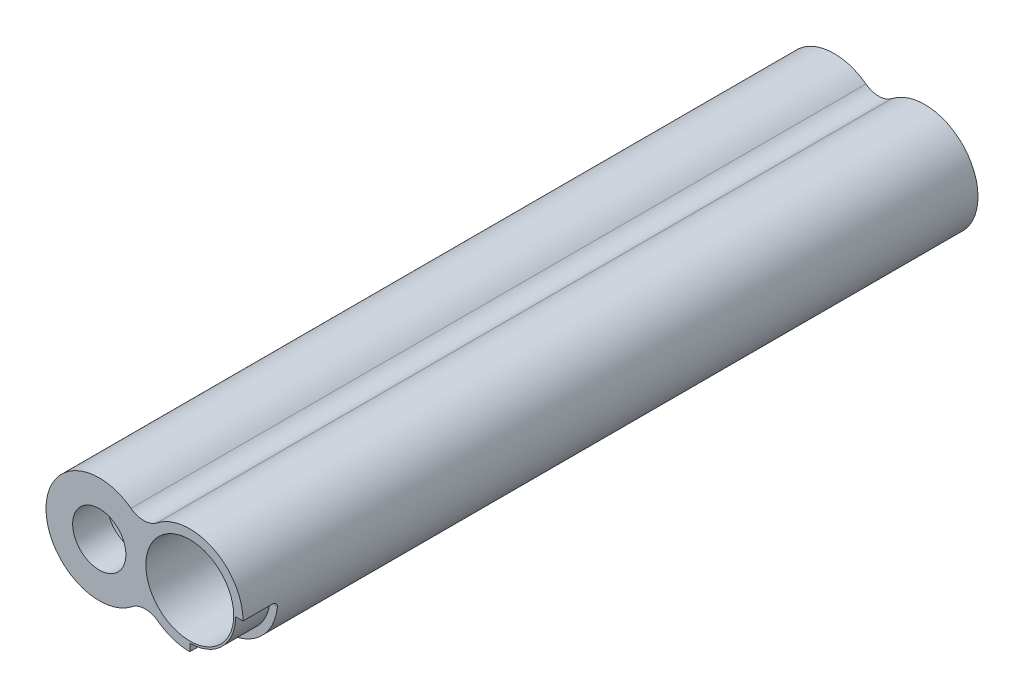
ISO-10303-21;
HEADER;
FILE_DESCRIPTION(('STEP AP214'),'2;1');
FILE_NAME('part.step','',(''),(''),'','','');
FILE_SCHEMA(('AUTOMOTIVE_DESIGN { 1 0 10303 214 1 1 1 1 }'));
ENDSEC;
DATA;
#1=APPLICATION_CONTEXT('core data for automotive mechanical design processes');
#2=APPLICATION_PROTOCOL_DEFINITION('international standard','automotive_design',2000,#1);
#3=PRODUCT_CONTEXT('',#1,'mechanical');
#4=PRODUCT('Part','Part','',(#3));
#5=PRODUCT_RELATED_PRODUCT_CATEGORY('part','',(#4));
#6=PRODUCT_DEFINITION_FORMATION('','',#4);
#7=PRODUCT_DEFINITION_CONTEXT('part definition',#1,'design');
#8=PRODUCT_DEFINITION('design','',#6,#7);
#9=PRODUCT_DEFINITION_SHAPE('','',#8);
#10=(LENGTH_UNIT() NAMED_UNIT(*) SI_UNIT(.MILLI.,.METRE.));
#11=(NAMED_UNIT(*) PLANE_ANGLE_UNIT() SI_UNIT($,.RADIAN.));
#12=(NAMED_UNIT(*) SI_UNIT($,.STERADIAN.) SOLID_ANGLE_UNIT());
#13=UNCERTAINTY_MEASURE_WITH_UNIT(LENGTH_MEASURE(1.E-05),#10,'distance_accuracy_value','');
#14=(GEOMETRIC_REPRESENTATION_CONTEXT(3) GLOBAL_UNCERTAINTY_ASSIGNED_CONTEXT((#13)) GLOBAL_UNIT_ASSIGNED_CONTEXT((#10,
#11,#12)) REPRESENTATION_CONTEXT('',''));
#15=CARTESIAN_POINT('',(0.,0.,0.));
#16=DIRECTION('',(0.,0.,1.));
#17=DIRECTION('',(1.,0.,0.));
#18=AXIS2_PLACEMENT_3D('',#15,#16,#17);
#19=CARTESIAN_POINT('',(8.49999999999999,0.106093378403053,-34.5));
#20=DIRECTION('',(0.,0.,1.));
#21=DIRECTION('',(1.,0.,0.));
#22=AXIS2_PLACEMENT_3D('',#19,#20,#21);
#23=CYLINDRICAL_SURFACE('',#22,4.125);
#24=CARTESIAN_POINT('',(8.49999999999999,0.106093378403053,34.5));
#25=DIRECTION('',(0.,0.,1.));
#26=DIRECTION('',(1.,0.,0.));
#27=AXIS2_PLACEMENT_3D('',#24,#25,#26);
#28=CIRCLE('',#27,4.125);
#29=CARTESIAN_POINT('',(12.625,0.106093378403053,34.5));
#30=VERTEX_POINT('',#29);
#31=EDGE_CURVE('E243',#30,#30,#28,.T.);
#32=ORIENTED_EDGE('',*,*,#31,.T.);
#33=EDGE_LOOP('',(#32));
#34=FACE_BOUND('',#33,.T.);
#35=CARTESIAN_POINT('',(8.49999999999999,0.106093378403053,-31.25));
#36=DIRECTION('',(0.,0.,-1.));
#37=DIRECTION('',(-1.,0.,0.));
#38=AXIS2_PLACEMENT_3D('',#35,#36,#37);
#39=CIRCLE('',#38,4.125);
#40=CARTESIAN_POINT('',(4.37499999999999,0.106093378403053,-31.25));
#41=VERTEX_POINT('',#40);
#42=EDGE_CURVE('E302',#41,#41,#39,.F.);
#43=ORIENTED_EDGE('',*,*,#42,.F.);
#44=EDGE_LOOP('',(#43));
#45=FACE_BOUND('',#44,.T.);
#46=ADVANCED_FACE('F42',(#34,#45),#23,.F.);
#47=CARTESIAN_POINT('',(0.,0.,-34.5));
#48=DIRECTION('',(0.,0.,1.));
#49=DIRECTION('',(1.,0.,0.));
#50=AXIS2_PLACEMENT_3D('',#47,#48,#49);
#51=CYLINDRICAL_SURFACE('',#50,4.125);
#52=CARTESIAN_POINT('',(0.,0.,-34.5));
#53=DIRECTION('',(0.,0.,1.));
#54=DIRECTION('',(1.,0.,0.));
#55=AXIS2_PLACEMENT_3D('',#52,#53,#54);
#56=CIRCLE('',#55,4.125);
#57=CARTESIAN_POINT('',(4.125,0.,-34.5));
#58=VERTEX_POINT('',#57);
#59=EDGE_CURVE('E247',#58,#58,#56,.T.);
#60=ORIENTED_EDGE('',*,*,#59,.F.);
#61=EDGE_LOOP('',(#60));
#62=FACE_BOUND('',#61,.T.);
#63=CARTESIAN_POINT('',(0.,0.,31.25));
#64=DIRECTION('',(0.,0.,1.));
#65=DIRECTION('',(1.,0.,0.));
#66=AXIS2_PLACEMENT_3D('',#63,#64,#65);
#67=CIRCLE('',#66,4.125);
#68=CARTESIAN_POINT('',(4.125,0.,31.25));
#69=VERTEX_POINT('',#68);
#70=EDGE_CURVE('E287',#69,#69,#67,.F.);
#71=ORIENTED_EDGE('',*,*,#70,.F.);
#72=EDGE_LOOP('',(#71));
#73=FACE_BOUND('',#72,.T.);
#74=ADVANCED_FACE('F374',(#62,#73),#51,.F.);
#75=CARTESIAN_POINT('',(4.31941580799457,-5.50841602256462,34.5));
#76=DIRECTION('',(0.,0.,-1.));
#77=DIRECTION('',(-1.,0.,0.));
#78=AXIS2_PLACEMENT_3D('',#75,#76,#77);
#79=CYLINDRICAL_SURFACE('',#78,2.);
#80=CARTESIAN_POINT('',(4.31941580799457,-5.50841602256462,-34.5));
#81=DIRECTION('',(0.,0.,1.));
#82=DIRECTION('',(1.,0.,0.));
#83=AXIS2_PLACEMENT_3D('',#80,#81,#82);
#84=CIRCLE('',#83,2.);
#85=CARTESIAN_POINT('',(5.51386843428184,-3.904270479431,-34.5));
#86=VERTEX_POINT('',#85);
#87=CARTESIAN_POINT('',(3.08529700571041,-3.93458287326044,-34.5));
#88=VERTEX_POINT('',#87);
#89=EDGE_CURVE('E251',#86,#88,#84,.T.);
#90=ORIENTED_EDGE('',*,*,#89,.F.);
#91=DIRECTION('',(0.,0.,-1.));
#92=VECTOR('',#91,1.);
#93=CARTESIAN_POINT('',(5.51386843428184,-3.904270479431,34.5));
#94=LINE('',#93,#92);
#95=CARTESIAN_POINT('',(5.51386843428184,-3.904270479431,34.5));
#96=VERTEX_POINT('',#95);
#97=EDGE_CURVE('E284',#96,#86,#94,.T.);
#98=ORIENTED_EDGE('',*,*,#97,.F.);
#99=CARTESIAN_POINT('',(4.31941580799457,-5.50841602256462,34.5));
#100=DIRECTION('',(0.,0.,1.));
#101=DIRECTION('',(1.,0.,0.));
#102=AXIS2_PLACEMENT_3D('',#99,#100,#101);
#103=CIRCLE('',#102,2.);
#104=CARTESIAN_POINT('',(3.08529700571041,-3.93458287326044,34.5));
#105=VERTEX_POINT('',#104);
#106=EDGE_CURVE('E255',#96,#105,#103,.T.);
#107=ORIENTED_EDGE('',*,*,#106,.T.);
#108=DIRECTION('',(0.,0.,-1.));
#109=VECTOR('',#108,1.);
#110=CARTESIAN_POINT('',(3.08529700571041,-3.93458287326044,34.5));
#111=LINE('',#110,#109);
#112=EDGE_CURVE('E270',#105,#88,#111,.T.);
#113=ORIENTED_EDGE('',*,*,#112,.T.);
#114=EDGE_LOOP('',(#90,#98,#107,#113));
#115=FACE_BOUND('',#114,.T.);
#116=ADVANCED_FACE('F370',(#115),#79,.F.);
#117=CARTESIAN_POINT('',(8.49999999999999,0.106093378403053,34.5));
#118=DIRECTION('',(0.,0.,-1.));
#119=DIRECTION('',(-1.,0.,0.));
#120=AXIS2_PLACEMENT_3D('',#117,#118,#119);
#121=CYLINDRICAL_SURFACE('',#120,5.);
#122=CARTESIAN_POINT('',(8.49999999999999,0.106093378403053,31.25));
#123=DIRECTION('',(0.,0.,1.));
#124=DIRECTION('',(1.,0.,0.));
#125=AXIS2_PLACEMENT_3D('',#122,#123,#124);
#126=CIRCLE('',#125,5.);
#127=CARTESIAN_POINT('',(8.99999999999999,-4.86884380713005,31.25));
#128=VERTEX_POINT('',#127);
#129=CARTESIAN_POINT('',(13.4749371855331,-0.393906621596947,31.25));
#130=VERTEX_POINT('',#129);
#131=EDGE_CURVE('E186',#128,#130,#126,.T.);
#132=ORIENTED_EDGE('',*,*,#131,.F.);
#133=CARTESIAN_POINT('',(8.99999999999999,-4.86884380713005,31.25));
#134=CARTESIAN_POINT('',(8.97202698889743,-4.87166437313728,31.2499752077107));
#135=CARTESIAN_POINT('',(8.9440325962255,-4.87423067547723,31.2523461658066));
#136=CARTESIAN_POINT('',(8.88880707401024,-4.87884112542635,31.2617241033905));
#137=CARTESIAN_POINT('',(8.86157541832725,-4.88088564127841,31.2687278007849));
#138=CARTESIAN_POINT('',(8.80862266956326,-4.88444405303997,31.2872220409736));
#139=CARTESIAN_POINT('',(8.7829025526213,-4.88595760912778,31.2987154473367));
#140=CARTESIAN_POINT('',(8.73374132977836,-4.88850067153528,31.3258607331188));
#141=CARTESIAN_POINT('',(8.71029970765888,-4.88953028770069,31.3415116675896));
#142=CARTESIAN_POINT('',(8.66642398971879,-4.89118439859808,31.3764866347712));
#143=CARTESIAN_POINT('',(8.64598216960979,-4.89180994844018,31.3958009293938));
#144=CARTESIAN_POINT('',(8.60861261522794,-4.8927618442048,31.4375874406513));
#145=CARTESIAN_POINT('',(8.59168563804698,-4.89308812571698,31.4600603358998));
#146=CARTESIAN_POINT('',(8.56181300768078,-4.89354695649803,31.5075530945586));
#147=CARTESIAN_POINT('',(8.54887264467543,-4.89367924921379,31.5325762841088));
#148=CARTESIAN_POINT('',(8.52737515002419,-4.89384330406367,31.5844330316142));
#149=CARTESIAN_POINT('',(8.5188155588362,-4.89387512266001,31.6112655641324));
#150=CARTESIAN_POINT('',(8.50839042346739,-4.8939013265886,31.6568771728251));
#151=CARTESIAN_POINT('',(8.50524611489833,-4.89390462958024,31.6753742089661));
#152=CARTESIAN_POINT('',(8.50105103487513,-4.89390663230538,31.7125782799934));
#153=CARTESIAN_POINT('',(8.49999738318929,-4.89390533837878,31.731284990214));
#154=CARTESIAN_POINT('',(8.49999999999999,-4.89390662159694,31.75));
#155=B_SPLINE_CURVE_WITH_KNOTS('',3,(#133,#134,#135,#136,#137,#138,#139,#140,#141,#142,#143,
#144,#145,#146,#147,#148,#149,#150,#151,#152,#153,#154),.UNSPECIFIED.,.F.,.F.,(4,2,2,2,2,2,2,2,
2,2,4),(0.,0.0842376118316366,0.168415608819224,0.252647383033798,0.336860028896335,
0.420851877584426,0.504861799267008,0.588982725446413,0.67305637078944,0.729233086954633,
0.78533235635474),.UNSPECIFIED.);
#156=CARTESIAN_POINT('',(8.49999999999999,-4.89390662159694,31.75));
#157=VERTEX_POINT('',#156);
#158=EDGE_CURVE('E57',#128,#157,#155,.T.);
#159=ORIENTED_EDGE('',*,*,#158,.T.);
#160=DIRECTION('',(0.,0.,1.));
#161=VECTOR('',#160,1.);
#162=CARTESIAN_POINT('',(8.49999999999999,-4.89390662159694,31.25));
#163=LINE('',#162,#161);
#164=CARTESIAN_POINT('',(8.49999999999999,-4.89390662159694,34.5));
#165=VERTEX_POINT('',#164);
#166=EDGE_CURVE('E190',#157,#165,#163,.T.);
#167=ORIENTED_EDGE('',*,*,#166,.T.);
#168=CARTESIAN_POINT('',(8.49999999999999,0.106093378403053,34.5));
#169=DIRECTION('',(0.,0.,1.));
#170=DIRECTION('',(1.,0.,0.));
#171=AXIS2_PLACEMENT_3D('',#168,#169,#170);
#172=CIRCLE('',#171,5.);
#173=EDGE_CURVE('E267',#96,#165,#172,.T.);
#174=ORIENTED_EDGE('',*,*,#173,.F.);
#175=ORIENTED_EDGE('',*,*,#97,.T.);
#176=CARTESIAN_POINT('',(8.49999999999999,0.106093378403053,-34.5));
#177=DIRECTION('',(0.,0.,1.));
#178=DIRECTION('',(1.,0.,0.));
#179=AXIS2_PLACEMENT_3D('',#176,#177,#178);
#180=CIRCLE('',#179,5.);
#181=CARTESIAN_POINT('',(5.41470299428959,4.04067625166349,-34.5));
#182=VERTEX_POINT('',#181);
#183=EDGE_CURVE('E260',#86,#182,#180,.T.);
#184=ORIENTED_EDGE('',*,*,#183,.T.);
#185=DIRECTION('',(0.,0.,-1.));
#186=VECTOR('',#185,1.);
#187=CARTESIAN_POINT('',(5.41470299428959,4.04067625166349,34.5));
#188=LINE('',#187,#186);
#189=CARTESIAN_POINT('',(5.41470299428959,4.04067625166349,34.5));
#190=VERTEX_POINT('',#189);
#191=EDGE_CURVE('E288',#190,#182,#188,.T.);
#192=ORIENTED_EDGE('',*,*,#191,.F.);
#193=CARTESIAN_POINT('',(13.5,0.106093378403053,34.5));
#194=VERTEX_POINT('',#193);
#195=EDGE_CURVE('E266',#194,#190,#172,.T.);
#196=ORIENTED_EDGE('',*,*,#195,.F.);
#197=DIRECTION('',(0.,0.,1.));
#198=VECTOR('',#197,1.);
#199=CARTESIAN_POINT('',(13.5,0.106093378403053,31.25));
#200=LINE('',#199,#198);
#201=CARTESIAN_POINT('',(13.5,0.106093378403053,31.75));
#202=VERTEX_POINT('',#201);
#203=EDGE_CURVE('E168',#202,#194,#200,.T.);
#204=ORIENTED_EDGE('',*,*,#203,.F.);
#205=CARTESIAN_POINT('',(13.5,0.106093378403053,31.75));
#206=CARTESIAN_POINT('',(13.4999932408429,0.106117265670772,31.7218736460125));
#207=CARTESIAN_POINT('',(13.4999998869568,0.103721530740548,31.6937543993476));
#208=CARTESIAN_POINT('',(13.4999900321643,0.0942669836490428,31.6383322147697));
#209=CARTESIAN_POINT('',(13.4999735490013,0.0872117481936161,31.6110286675027));
#210=CARTESIAN_POINT('',(13.4998675951179,0.0686093539716101,31.5579815681434));
#211=CARTESIAN_POINT('',(13.4997780889372,0.0570600142862309,31.5322387804844));
#212=CARTESIAN_POINT('',(13.4994366376797,0.0298076866404999,31.4830620899761));
#213=CARTESIAN_POINT('',(13.4991847209505,0.0141054238280858,31.4596277850187));
#214=CARTESIAN_POINT('',(13.4984151561066,-0.021000157381926,31.4157392977171));
#215=CARTESIAN_POINT('',(13.4978976217546,-0.04040188908267,31.3952838443576));
#216=CARTESIAN_POINT('',(13.4964913237933,-0.0823585214143654,31.3579198449318));
#217=CARTESIAN_POINT('',(13.4956025032004,-0.104913905703148,31.3410118439145));
#218=CARTESIAN_POINT('',(13.4933659020641,-0.152484475449345,31.3112499446839));
#219=CARTESIAN_POINT('',(13.4920188441402,-0.177495744181763,31.2983897244067));
#220=CARTESIAN_POINT('',(13.4888067355434,-0.229284987690532,31.2770486355357));
#221=CARTESIAN_POINT('',(13.4869419530924,-0.25606204218965,31.2685655057554));
#222=CARTESIAN_POINT('',(13.4833938621406,-0.301482541656724,31.2582630234864));
#223=CARTESIAN_POINT('',(13.4818577000426,-0.319857935614226,31.2551645660584));
#224=CARTESIAN_POINT('',(13.4785624063935,-0.356792353276013,31.2510332419054));
#225=CARTESIAN_POINT('',(13.4768036038811,-0.375351069473158,31.2499973639538));
#226=CARTESIAN_POINT('',(13.4749371855331,-0.393906621596947,31.25));
#227=B_SPLINE_CURVE_WITH_KNOTS('',3,(#205,#206,#207,#208,#209,#210,#211,#212,#213,#214,#215,
#216,#217,#218,#219,#220,#221,#222,#223,#224,#225,#226),.UNSPECIFIED.,.F.,.F.,(4,2,2,2,2,2,2,2,
2,2,4),(0.,0.084267040934725,0.168469472229897,0.252712816716624,0.336941461051098,
0.421134060771587,0.505339586826214,0.589412935480503,0.673442808600136,0.729427951454082,
0.785331299680381),.UNSPECIFIED.);
#228=EDGE_CURVE('E11',#202,#130,#227,.T.);
#229=ORIENTED_EDGE('',*,*,#228,.T.);
#230=EDGE_LOOP('',(#132,#159,#167,#174,#175,#184,#192,#196,#204,#229));
#231=FACE_BOUND('',#230,.T.);
#232=ADVANCED_FACE('F373',(#231),#121,.T.);
#233=CARTESIAN_POINT('',(4.18058419200544,5.61450940096767,34.5));
#234=DIRECTION('',(0.,0.,-1.));
#235=DIRECTION('',(-1.,0.,0.));
#236=AXIS2_PLACEMENT_3D('',#233,#234,#235);
#237=CYLINDRICAL_SURFACE('',#236,2.);
#238=CARTESIAN_POINT('',(4.18058419200544,5.61450940096767,-34.5));
#239=DIRECTION('',(0.,0.,-1.));
#240=DIRECTION('',(-1.,0.,0.));
#241=AXIS2_PLACEMENT_3D('',#238,#239,#240);
#242=CIRCLE('',#241,2.);
#243=CARTESIAN_POINT('',(2.98613156571816,4.01036385783405,-34.5));
#244=VERTEX_POINT('',#243);
#245=EDGE_CURVE('E279',#182,#244,#242,.T.);
#246=ORIENTED_EDGE('',*,*,#245,.T.);
#247=DIRECTION('',(0.,0.,-1.));
#248=VECTOR('',#247,1.);
#249=CARTESIAN_POINT('',(2.98613156571816,4.01036385783405,34.5));
#250=LINE('',#249,#248);
#251=CARTESIAN_POINT('',(2.98613156571816,4.01036385783405,34.5));
#252=VERTEX_POINT('',#251);
#253=EDGE_CURVE('E292',#252,#244,#250,.T.);
#254=ORIENTED_EDGE('',*,*,#253,.F.);
#255=CARTESIAN_POINT('',(4.18058419200544,5.61450940096767,34.5));
#256=DIRECTION('',(0.,0.,-1.));
#257=DIRECTION('',(-1.,0.,0.));
#258=AXIS2_PLACEMENT_3D('',#255,#256,#257);
#259=CIRCLE('',#258,2.);
#260=EDGE_CURVE('E263',#190,#252,#259,.T.);
#261=ORIENTED_EDGE('',*,*,#260,.F.);
#262=ORIENTED_EDGE('',*,*,#191,.T.);
#263=EDGE_LOOP('',(#246,#254,#261,#262));
#264=FACE_BOUND('',#263,.T.);
#265=ADVANCED_FACE('F368',(#264),#237,.F.);
#266=CARTESIAN_POINT('',(0.,0.,34.5));
#267=DIRECTION('',(0.,0.,-1.));
#268=DIRECTION('',(-1.,0.,0.));
#269=AXIS2_PLACEMENT_3D('',#266,#267,#268);
#270=CYLINDRICAL_SURFACE('',#269,5.);
#271=CARTESIAN_POINT('',(0.,0.,-31.25));
#272=DIRECTION('',(0.,0.,-1.));
#273=DIRECTION('',(-1.,0.,0.));
#274=AXIS2_PLACEMENT_3D('',#271,#272,#273);
#275=CIRCLE('',#274,5.);
#276=CARTESIAN_POINT('',(-0.500000000000042,-4.97493718553309,-31.25));
#277=VERTEX_POINT('',#276);
#278=CARTESIAN_POINT('',(-4.96826960374601,-0.562403008965512,-31.25));
#279=VERTEX_POINT('',#278);
#280=EDGE_CURVE('E199',#277,#279,#275,.T.);
#281=ORIENTED_EDGE('',*,*,#280,.F.);
#282=CARTESIAN_POINT('',(-0.500000000000042,-4.97493718553309,-31.25));
#283=CARTESIAN_POINT('',(-0.472026988897487,-4.97775775154034,-31.2499752077107));
#284=CARTESIAN_POINT('',(-0.444032596225557,-4.98032405388029,-31.2523461658066));
#285=CARTESIAN_POINT('',(-0.388807074010288,-4.9849345038294,-31.2617241033905));
#286=CARTESIAN_POINT('',(-0.361575418327302,-4.98697901968146,-31.2687278007849));
#287=CARTESIAN_POINT('',(-0.308622669563317,-4.99053743144302,-31.2872220409736));
#288=CARTESIAN_POINT('',(-0.28290255262136,-4.99205098753083,-31.2987154473367));
#289=CARTESIAN_POINT('',(-0.233741329778419,-4.99459404993834,-31.3258607331188));
#290=CARTESIAN_POINT('',(-0.210299707658936,-4.99562366610375,-31.3415116675896));
#291=CARTESIAN_POINT('',(-0.16642398971884,-4.99727777700115,-31.3764866347712));
#292=CARTESIAN_POINT('',(-0.145982169609854,-4.99790332684324,-31.3958009293938));
#293=CARTESIAN_POINT('',(-0.108612615227994,-4.99885522260785,-31.4375874406513));
#294=CARTESIAN_POINT('',(-0.0916856380470353,-4.99918150412003,-31.4600603358998));
#295=CARTESIAN_POINT('',(-0.0618130076808295,-4.99964033490108,-31.5075530945586));
#296=CARTESIAN_POINT('',(-0.0488726446754892,-4.99977262761684,-31.5325762841088));
#297=CARTESIAN_POINT('',(-0.027375150024255,-4.99993668246673,-31.5844330316142));
#298=CARTESIAN_POINT('',(-0.0188155588362526,-4.99996850106307,-31.6112655641324));
#299=CARTESIAN_POINT('',(-0.00839042346744153,-4.99999470499166,-31.6568771728251));
#300=CARTESIAN_POINT('',(-0.00524611489839541,-4.9999980079833,-31.6753742089661));
#301=CARTESIAN_POINT('',(-0.00105103487520538,-5.00000001070843,-31.7125782799934));
#302=CARTESIAN_POINT('',(2.61681063541184E-06,-4.99999871678183,-31.731284990214));
#303=CARTESIAN_POINT('',(0.,-5.,-31.75));
#304=B_SPLINE_CURVE_WITH_KNOTS('',3,(#282,#283,#284,#285,#286,#287,#288,#289,#290,#291,#292,
#293,#294,#295,#296,#297,#298,#299,#300,#301,#302,#303),.UNSPECIFIED.,.F.,.F.,(4,2,2,2,2,2,2,2,
2,2,4),(0.,0.0842376118316362,0.168415608819222,0.252647383033794,0.336860028896335,
0.420851877584425,0.504861799267,0.588982725446406,0.67305637078943,0.729233086954614,
0.785332356354728),.UNSPECIFIED.);
#305=CARTESIAN_POINT('',(0.,-5.,-31.75));
#306=VERTEX_POINT('',#305);
#307=EDGE_CURVE('E358',#277,#306,#304,.T.);
#308=ORIENTED_EDGE('',*,*,#307,.T.);
#309=DIRECTION('',(0.,0.,-1.));
#310=VECTOR('',#309,1.);
#311=CARTESIAN_POINT('',(0.,-5.,-31.25));
#312=LINE('',#311,#310);
#313=CARTESIAN_POINT('',(0.,-5.,-34.5));
#314=VERTEX_POINT('',#313);
#315=EDGE_CURVE('E208',#306,#314,#312,.T.);
#316=ORIENTED_EDGE('',*,*,#315,.T.);
#317=CARTESIAN_POINT('',(0.,0.,-34.5));
#318=DIRECTION('',(0.,0.,1.));
#319=DIRECTION('',(1.,0.,0.));
#320=AXIS2_PLACEMENT_3D('',#317,#318,#319);
#321=CIRCLE('',#320,5.);
#322=EDGE_CURVE('E274',#314,#88,#321,.T.);
#323=ORIENTED_EDGE('',*,*,#322,.T.);
#324=ORIENTED_EDGE('',*,*,#112,.F.);
#325=CARTESIAN_POINT('',(0.,0.,34.5));
#326=DIRECTION('',(0.,0.,1.));
#327=DIRECTION('',(1.,0.,0.));
#328=AXIS2_PLACEMENT_3D('',#325,#326,#327);
#329=CIRCLE('',#328,5.);
#330=EDGE_CURVE('E259',#252,#105,#329,.T.);
#331=ORIENTED_EDGE('',*,*,#330,.F.);
#332=ORIENTED_EDGE('',*,*,#253,.T.);
#333=CARTESIAN_POINT('',(-4.99961057128173,-0.0624030089655114,-34.5));
#334=VERTEX_POINT('',#333);
#335=EDGE_CURVE('E275',#244,#334,#321,.T.);
#336=ORIENTED_EDGE('',*,*,#335,.T.);
#337=DIRECTION('',(0.,0.,-1.));
#338=VECTOR('',#337,1.);
#339=CARTESIAN_POINT('',(-4.99961057128173,-0.0624030089655114,-31.25));
#340=LINE('',#339,#338);
#341=CARTESIAN_POINT('',(-4.99961057128173,-0.0624030089655114,-31.75));
#342=VERTEX_POINT('',#341);
#343=EDGE_CURVE('E226',#342,#334,#340,.T.);
#344=ORIENTED_EDGE('',*,*,#343,.F.);
#345=CARTESIAN_POINT('',(-4.99961057128173,-0.0624030089655114,-31.75));
#346=CARTESIAN_POINT('',(-4.99960411251956,-0.0623790979294933,-31.7218790657774));
#347=CARTESIAN_POINT('',(-4.99958086484635,-0.0647739421763674,-31.6937651551348));
#348=CARTESIAN_POINT('',(-4.99945305290727,-0.0742249230464561,-31.6383531365944));
#349=CARTESIAN_POINT('',(-4.99934855031848,-0.0812775235579582,-31.6110544262267));
#350=CARTESIAN_POINT('',(-4.99901054191958,-0.0998728483853651,-31.5580165426178));
#351=CARTESIAN_POINT('',(-4.99877697285204,-0.111417773636352,-31.5322781409774));
#352=CARTESIAN_POINT('',(-4.99809562411239,-0.138658804306043,-31.4831102547385));
#353=CARTESIAN_POINT('',(-4.99764788266248,-0.154354168794834,-31.4596803590527));
#354=CARTESIAN_POINT('',(-4.99644065238305,-0.18943989048248,-31.415803571871));
#355=CARTESIAN_POINT('',(-4.99568133743747,-0.208828183491484,-31.3953550251477));
#356=CARTESIAN_POINT('',(-4.99375241158158,-0.250751378427417,-31.3580033190414));
#357=CARTESIAN_POINT('',(-4.99258273911229,-0.273286752152118,-31.3411006922011));
#358=CARTESIAN_POINT('',(-4.98975390621944,-0.320813493553402,-31.3113431834211));
#359=CARTESIAN_POINT('',(-4.98809542940595,-0.345801398941014,-31.2984826999636));
#360=CARTESIAN_POINT('',(-4.9842387602852,-0.397536218234256,-31.2771354200162));
#361=CARTESIAN_POINT('',(-4.98204083566827,-0.424282254896822,-31.268646460697));
#362=CARTESIAN_POINT('',(-4.97792097722209,-0.469721050758202,-31.2583094198425));
#363=CARTESIAN_POINT('',(-4.97614847037054,-0.488149342419233,-31.2551932899287));
#364=CARTESIAN_POINT('',(-4.97237642808697,-0.52518788426673,-31.2510387754586));
#365=CARTESIAN_POINT('',(-4.97037723210587,-0.543797825230973,-31.2499973265288));
#366=CARTESIAN_POINT('',(-4.96826960374601,-0.562403008965512,-31.25));
#367=B_SPLINE_CURVE_WITH_KNOTS('',3,(#345,#346,#347,#348,#349,#350,#351,#352,#353,#354,#355,
#356,#357,#358,#359,#360,#361,#362,#363,#364,#365,#366),.UNSPECIFIED.,.F.,.F.,(4,2,2,2,2,2,2,2,
2,2,4),(0.,0.0842509632100862,0.168438037530926,0.252666409858302,0.336879756007484,
0.421046167888098,0.505225211233553,0.58928708138105,0.673307321525044,0.729518778531917,
0.7856471475843),.UNSPECIFIED.);
#368=EDGE_CURVE('E348',#342,#279,#367,.T.);
#369=ORIENTED_EDGE('',*,*,#368,.T.);
#370=EDGE_LOOP('',(#281,#308,#316,#323,#324,#331,#332,#336,#344,#369));
#371=FACE_BOUND('',#370,.T.);
#372=ADVANCED_FACE('F364',(#371),#270,.T.);
#373=CARTESIAN_POINT('',(2.15970790399729,-2.75420801128231,34.5));
#374=DIRECTION('',(0.,0.,1.));
#375=DIRECTION('',(1.,0.,0.));
#376=AXIS2_PLACEMENT_3D('',#373,#374,#375);
#377=PLANE('',#376);
#378=DIRECTION('',(0.,-1.,0.));
#379=VECTOR('',#378,1.);
#380=CARTESIAN_POINT('',(8.49999999999999,-4.89390662159694,34.5));
#381=LINE('',#380,#379);
#382=CARTESIAN_POINT('',(8.49999999999999,-4.19390662159694,34.5));
#383=VERTEX_POINT('',#382);
#384=EDGE_CURVE('E181',#383,#165,#381,.T.);
#385=ORIENTED_EDGE('',*,*,#384,.F.);
#386=CARTESIAN_POINT('',(8.49999999999999,0.106093378403053,34.5));
#387=DIRECTION('',(0.,0.,-1.));
#388=DIRECTION('',(1.,0.,0.));
#389=AXIS2_PLACEMENT_3D('',#386,#387,#388);
#390=CIRCLE('',#389,4.3);
#391=CARTESIAN_POINT('',(12.8,0.106093378403053,34.5));
#392=VERTEX_POINT('',#391);
#393=EDGE_CURVE('E164',#392,#383,#390,.T.);
#394=ORIENTED_EDGE('',*,*,#393,.F.);
#395=DIRECTION('',(-1.,0.,0.));
#396=VECTOR('',#395,1.);
#397=CARTESIAN_POINT('',(13.5,0.106093378403053,34.5));
#398=LINE('',#397,#396);
#399=EDGE_CURVE('E171',#194,#392,#398,.T.);
#400=ORIENTED_EDGE('',*,*,#399,.F.);
#401=ORIENTED_EDGE('',*,*,#195,.T.);
#402=ORIENTED_EDGE('',*,*,#260,.T.);
#403=ORIENTED_EDGE('',*,*,#330,.T.);
#404=ORIENTED_EDGE('',*,*,#106,.F.);
#405=ORIENTED_EDGE('',*,*,#173,.T.);
#406=EDGE_LOOP('',(#385,#394,#400,#401,#402,#403,#404,#405));
#407=FACE_BOUND('',#406,.T.);
#408=ORIENTED_EDGE('',*,*,#31,.F.);
#409=EDGE_LOOP('',(#408));
#410=FACE_BOUND('',#409,.T.);
#411=CARTESIAN_POINT('',(0.,0.,34.5));
#412=DIRECTION('',(0.,0.,1.));
#413=DIRECTION('',(1.,0.,0.));
#414=AXIS2_PLACEMENT_3D('',#411,#412,#413);
#415=CIRCLE('',#414,2.5);
#416=CARTESIAN_POINT('',(2.5,0.,34.5));
#417=VERTEX_POINT('',#416);
#418=EDGE_CURVE('E235',#417,#417,#415,.T.);
#419=ORIENTED_EDGE('',*,*,#418,.F.);
#420=EDGE_LOOP('',(#419));
#421=FACE_BOUND('',#420,.T.);
#422=ADVANCED_FACE('F177',(#407,#410,#421),#377,.T.);
#423=CARTESIAN_POINT('',(2.15970790399729,-2.75420801128231,-34.5));
#424=DIRECTION('',(0.,0.,1.));
#425=DIRECTION('',(1.,0.,0.));
#426=AXIS2_PLACEMENT_3D('',#423,#424,#425);
#427=PLANE('',#426);
#428=ORIENTED_EDGE('',*,*,#59,.T.);
#429=EDGE_LOOP('',(#428));
#430=FACE_BOUND('',#429,.T.);
#431=ORIENTED_EDGE('',*,*,#322,.F.);
#432=DIRECTION('',(0.,-1.,0.));
#433=VECTOR('',#432,1.);
#434=CARTESIAN_POINT('',(0.,-4.30006339490543,-34.5));
#435=LINE('',#434,#433);
#436=CARTESIAN_POINT('',(0.,-4.30006339490543,-34.5));
#437=VERTEX_POINT('',#436);
#438=EDGE_CURVE('E193',#437,#314,#435,.T.);
#439=ORIENTED_EDGE('',*,*,#438,.F.);
#440=CARTESIAN_POINT('',(0.,0.,-34.5));
#441=DIRECTION('',(0.,0.,-1.));
#442=DIRECTION('',(-1.,0.,0.));
#443=AXIS2_PLACEMENT_3D('',#440,#441,#442);
#444=CIRCLE('',#443,4.30006339490543);
#445=CARTESIAN_POINT('',(-4.29961057128173,-0.0624030089655114,-34.5));
#446=VERTEX_POINT('',#445);
#447=EDGE_CURVE('E204',#437,#446,#444,.T.);
#448=ORIENTED_EDGE('',*,*,#447,.T.);
#449=DIRECTION('',(-1.,0.,0.));
#450=VECTOR('',#449,1.);
#451=CARTESIAN_POINT('',(-4.29961057128173,-0.0624030089655114,-34.5));
#452=LINE('',#451,#450);
#453=EDGE_CURVE('E212',#446,#334,#452,.T.);
#454=ORIENTED_EDGE('',*,*,#453,.T.);
#455=ORIENTED_EDGE('',*,*,#335,.F.);
#456=ORIENTED_EDGE('',*,*,#245,.F.);
#457=ORIENTED_EDGE('',*,*,#183,.F.);
#458=ORIENTED_EDGE('',*,*,#89,.T.);
#459=EDGE_LOOP('',(#431,#439,#448,#454,#455,#456,#457,#458));
#460=FACE_BOUND('',#459,.T.);
#461=CARTESIAN_POINT('',(8.49999999999999,0.106093378403053,-34.5));
#462=DIRECTION('',(0.,0.,-1.));
#463=DIRECTION('',(-1.,0.,0.));
#464=AXIS2_PLACEMENT_3D('',#461,#462,#463);
#465=CIRCLE('',#464,2.5);
#466=CARTESIAN_POINT('',(5.99999999999999,0.106093378403053,-34.5));
#467=VERTEX_POINT('',#466);
#468=EDGE_CURVE('E222',#467,#467,#465,.T.);
#469=ORIENTED_EDGE('',*,*,#468,.F.);
#470=EDGE_LOOP('',(#469));
#471=FACE_BOUND('',#470,.T.);
#472=ADVANCED_FACE('F394',(#430,#460,#471),#427,.F.);
#473=CARTESIAN_POINT('',(0.,0.,31.25));
#474=DIRECTION('',(0.,0.,1.));
#475=DIRECTION('',(1.,0.,0.));
#476=AXIS2_PLACEMENT_3D('',#473,#474,#475);
#477=PLANE('',#476);
#478=CARTESIAN_POINT('',(0.,0.,31.25));
#479=DIRECTION('',(0.,0.,1.));
#480=DIRECTION('',(1.,0.,0.));
#481=AXIS2_PLACEMENT_3D('',#478,#479,#480);
#482=CIRCLE('',#481,2.5);
#483=CARTESIAN_POINT('',(2.5,0.,31.25));
#484=VERTEX_POINT('',#483);
#485=EDGE_CURVE('E239',#484,#484,#482,.T.);
#486=ORIENTED_EDGE('',*,*,#485,.T.);
#487=EDGE_LOOP('',(#486));
#488=FACE_BOUND('',#487,.T.);
#489=ORIENTED_EDGE('',*,*,#70,.T.);
#490=EDGE_LOOP('',(#489));
#491=FACE_BOUND('',#490,.T.);
#492=ADVANCED_FACE('F396',(#488,#491),#477,.F.);
#493=CARTESIAN_POINT('',(0.,0.,31.25));
#494=DIRECTION('',(0.,0.,1.));
#495=DIRECTION('',(1.,0.,0.));
#496=AXIS2_PLACEMENT_3D('',#493,#494,#495);
#497=CYLINDRICAL_SURFACE('',#496,2.5);
#498=ORIENTED_EDGE('',*,*,#485,.F.);
#499=EDGE_LOOP('',(#498));
#500=FACE_BOUND('',#499,.T.);
#501=ORIENTED_EDGE('',*,*,#418,.T.);
#502=EDGE_LOOP('',(#501));
#503=FACE_BOUND('',#502,.T.);
#504=ADVANCED_FACE('F617',(#500,#503),#497,.F.);
#505=CARTESIAN_POINT('',(8.49999999999999,0.106093378403053,-31.25));
#506=DIRECTION('',(0.,0.,-1.));
#507=DIRECTION('',(-1.,0.,0.));
#508=AXIS2_PLACEMENT_3D('',#505,#506,#507);
#509=PLANE('',#508);
#510=CARTESIAN_POINT('',(8.49999999999999,0.106093378403053,-31.25));
#511=DIRECTION('',(0.,0.,-1.));
#512=DIRECTION('',(-1.,0.,0.));
#513=AXIS2_PLACEMENT_3D('',#510,#511,#512);
#514=CIRCLE('',#513,2.5);
#515=CARTESIAN_POINT('',(5.99999999999999,0.106093378403053,-31.25));
#516=VERTEX_POINT('',#515);
#517=EDGE_CURVE('E231',#516,#516,#514,.T.);
#518=ORIENTED_EDGE('',*,*,#517,.T.);
#519=EDGE_LOOP('',(#518));
#520=FACE_BOUND('',#519,.T.);
#521=ORIENTED_EDGE('',*,*,#42,.T.);
#522=EDGE_LOOP('',(#521));
#523=FACE_BOUND('',#522,.T.);
#524=ADVANCED_FACE('F607',(#520,#523),#509,.F.);
#525=CARTESIAN_POINT('',(8.49999999999999,0.106093378403053,-31.25));
#526=DIRECTION('',(0.,0.,-1.));
#527=DIRECTION('',(-1.,0.,0.));
#528=AXIS2_PLACEMENT_3D('',#525,#526,#527);
#529=CYLINDRICAL_SURFACE('',#528,2.5);
#530=ORIENTED_EDGE('',*,*,#517,.F.);
#531=EDGE_LOOP('',(#530));
#532=FACE_BOUND('',#531,.T.);
#533=ORIENTED_EDGE('',*,*,#468,.T.);
#534=EDGE_LOOP('',(#533));
#535=FACE_BOUND('',#534,.T.);
#536=ADVANCED_FACE('F598',(#532,#535),#529,.F.);
#537=CARTESIAN_POINT('',(0.,-4.30006339490543,-31.25));
#538=DIRECTION('',(1.,0.,0.));
#539=DIRECTION('',(0.,1.,0.));
#540=AXIS2_PLACEMENT_3D('',#537,#538,#539);
#541=PLANE('',#540);
#542=ORIENTED_EDGE('',*,*,#315,.F.);
#543=DIRECTION('',(0.,-1.,0.));
#544=VECTOR('',#543,1.);
#545=CARTESIAN_POINT('',(0.,-4.30006339490543,-31.75));
#546=LINE('',#545,#544);
#547=CARTESIAN_POINT('',(0.,-4.30006339490543,-31.75));
#548=VERTEX_POINT('',#547);
#549=EDGE_CURVE('E313',#306,#548,#546,.F.);
#550=ORIENTED_EDGE('',*,*,#549,.T.);
#551=DIRECTION('',(0.,0.,-1.));
#552=VECTOR('',#551,1.);
#553=CARTESIAN_POINT('',(0.,-4.30006339490543,-31.25));
#554=LINE('',#553,#552);
#555=EDGE_CURVE('E219',#548,#437,#554,.T.);
#556=ORIENTED_EDGE('',*,*,#555,.T.);
#557=ORIENTED_EDGE('',*,*,#438,.T.);
#558=EDGE_LOOP('',(#542,#550,#556,#557));
#559=FACE_BOUND('',#558,.T.);
#560=ADVANCED_FACE('F463',(#559),#541,.F.);
#561=CARTESIAN_POINT('',(0.,0.,-31.25));
#562=DIRECTION('',(0.,0.,-1.));
#563=DIRECTION('',(-1.,0.,0.));
#564=AXIS2_PLACEMENT_3D('',#561,#562,#563);
#565=CYLINDRICAL_SURFACE('',#564,4.30006339490543);
#566=ORIENTED_EDGE('',*,*,#555,.F.);
#567=CARTESIAN_POINT('',(0.,-4.30006339490543,-31.75));
#568=CARTESIAN_POINT('',(2.38860312324769E-05,-4.30005553645845,-31.7218746295357));
#569=CARTESIAN_POINT('',(-0.00237168214004423,-4.30006326342194,-31.6937563558055));
#570=CARTESIAN_POINT('',(-0.0118256048615294,-4.3000518061976,-31.6383358678088));
#571=CARTESIAN_POINT('',(-0.0188804114371186,-4.30003264247434,-31.6110330491022));
#572=CARTESIAN_POINT('',(-0.0374817158429896,-4.29990945651991,-31.5579872430239));
#573=CARTESIAN_POINT('',(-0.0490304031304195,-4.29980539289764,-31.5322450230662));
#574=CARTESIAN_POINT('',(-0.0762810876301952,-4.29940839940905,-31.4830694995475));
#575=CARTESIAN_POINT('',(-0.0919823620076225,-4.29911550239994,-31.4596357951199));
#576=CARTESIAN_POINT('',(-0.127082326916122,-4.29822079813298,-31.4157522933514));
#577=CARTESIAN_POINT('',(-0.1464788862585,-4.29761916859397,-31.3953007880251));
#578=CARTESIAN_POINT('',(-0.188421046105329,-4.29598443152153,-31.3579449685996));
#579=CARTESIAN_POINT('',(-0.210967083256822,-4.29495126411963,-31.3410411471699));
#580=CARTESIAN_POINT('',(-0.258497042702966,-4.2923524012027,-31.3112963676683));
#581=CARTESIAN_POINT('',(-0.283475521350219,-4.2907878761481,-31.2984465984298));
#582=CARTESIAN_POINT('',(-0.335186588287182,-4.28705789065001,-31.2771176740793));
#583=CARTESIAN_POINT('',(-0.361918306213741,-4.28489272668403,-31.2686363685631));
#584=CARTESIAN_POINT('',(-0.407339001672515,-4.28076573523153,-31.2583054611523));
#585=CARTESIAN_POINT('',(-0.425766026125932,-4.27897322768121,-31.2551904785937));
#586=CARTESIAN_POINT('',(-0.462798010364138,-4.2751272360791,-31.2510379051459));
#587=CARTESIAN_POINT('',(-0.481402667576442,-4.27307414089908,-31.2499972566355));
#588=CARTESIAN_POINT('',(-0.5,-4.27089512868269,-31.25));
#589=B_SPLINE_CURVE_WITH_KNOTS('',3,(#567,#568,#569,#570,#571,#572,#573,#574,#575,#576,#577,
#578,#579,#580,#581,#582,#583,#584,#585,#586,#587,#588),.UNSPECIFIED.,.F.,.F.,(4,2,2,2,2,2,2,2,
2,2,4),(0.,0.0842641200018628,0.168464147388025,0.25270524921542,0.336931696954419,
0.421109714867443,0.505299414917039,0.589304854165223,0.67326890158522,0.729481378813536,
0.785610935965416),.UNSPECIFIED.);
#590=CARTESIAN_POINT('',(-0.5,-4.27089512868269,-31.25));
#591=VERTEX_POINT('',#590);
#592=EDGE_CURVE('E325',#548,#591,#589,.T.);
#593=ORIENTED_EDGE('',*,*,#592,.T.);
#594=CARTESIAN_POINT('',(0.,0.,-31.25));
#595=DIRECTION('',(0.,0.,-1.));
#596=DIRECTION('',(-1.,0.,0.));
#597=AXIS2_PLACEMENT_3D('',#594,#595,#596);
#598=CIRCLE('',#597,4.30006339490543);
#599=CARTESIAN_POINT('',(-4.26312655872566,-0.562403008965512,-31.25));
#600=VERTEX_POINT('',#599);
#601=EDGE_CURVE('E203',#591,#600,#598,.T.);
#602=ORIENTED_EDGE('',*,*,#601,.T.);
#603=CARTESIAN_POINT('',(-4.26312655872566,-0.562403008965512,-31.25));
#604=CARTESIAN_POINT('',(-4.26682095051932,-0.534480240377368,-31.2499748921934));
#605=CARTESIAN_POINT('',(-4.27021987254399,-0.506520694890362,-31.2523378267657));
#606=CARTESIAN_POINT('',(-4.27639894063318,-0.451335085806666,-31.2616968457927));
#607=CARTESIAN_POINT('',(-4.27917945974025,-0.424108588770187,-31.268690126876));
#608=CARTESIAN_POINT('',(-4.28410025059236,-0.371140689461184,-31.2871740999059));
#609=CARTESIAN_POINT('',(-4.28624004360133,-0.345400409189332,-31.2986681399941));
#610=CARTESIAN_POINT('',(-4.28992134843893,-0.296188699606143,-31.3258311923614));
#611=CARTESIAN_POINT('',(-4.29146302445033,-0.272716648997392,-31.3414990569335));
#612=CARTESIAN_POINT('',(-4.29402654247432,-0.228830651258914,-31.3764852218794));
#613=CARTESIAN_POINT('',(-4.29505090646784,-0.20840221682054,-31.3957851699088));
#614=CARTESIAN_POINT('',(-4.29670073734571,-0.17105066872111,-31.437544965751));
#615=CARTESIAN_POINT('',(-4.29732611477089,-0.15412834175927,-31.4600055208454));
#616=CARTESIAN_POINT('',(-4.29829342388202,-0.124269842168242,-31.5074592415332));
#617=CARTESIAN_POINT('',(-4.298635168932,-0.111336297751646,-31.5324540626085));
#618=CARTESIAN_POINT('',(-4.2991382509406,-0.0898428105235452,-31.5842531866392));
#619=CARTESIAN_POINT('',(-4.29929968846536,-0.0812804311522317,-31.6110564720719));
#620=CARTESIAN_POINT('',(-4.29948205559344,-0.0708298907548747,-31.656676779565));
#621=CARTESIAN_POINT('',(-4.29953176336769,-0.0676719490620891,-31.6752129280122));
#622=CARTESIAN_POINT('',(-4.29959526229844,-0.06345861707166,-31.712496842049));
#623=CARTESIAN_POINT('',(-4.29960910273284,-0.0624003425249238,-31.731244281719));
#624=CARTESIAN_POINT('',(-4.29961057128173,-0.0624030089655114,-31.75));
#625=B_SPLINE_CURVE_WITH_KNOTS('',3,(#603,#604,#605,#606,#607,#608,#609,#610,#611,#612,#613,
#614,#615,#616,#617,#618,#619,#620,#621,#622,#623,#624),.UNSPECIFIED.,.F.,.F.,(4,2,2,2,2,2,2,2,
2,2,4),(0.,0.0843946767100504,0.16873830463601,0.253144795857279,0.337528101123823,
0.421495953584098,0.50548262636749,0.589524520398497,0.67351951679399,0.729818142239977,
0.786039378279149),.UNSPECIFIED.);
#626=CARTESIAN_POINT('',(-4.29961057128173,-0.0624030089655114,-31.75));
#627=VERTEX_POINT('',#626);
#628=EDGE_CURVE('E316',#600,#627,#625,.T.);
#629=ORIENTED_EDGE('',*,*,#628,.T.);
#630=DIRECTION('',(0.,0.,-1.));
#631=VECTOR('',#630,1.);
#632=CARTESIAN_POINT('',(-4.29961057128173,-0.0624030089655114,-31.25));
#633=LINE('',#632,#631);
#634=EDGE_CURVE('E223',#627,#446,#633,.T.);
#635=ORIENTED_EDGE('',*,*,#634,.T.);
#636=ORIENTED_EDGE('',*,*,#447,.F.);
#637=EDGE_LOOP('',(#566,#593,#602,#629,#635,#636));
#638=FACE_BOUND('',#637,.T.);
#639=ADVANCED_FACE('F332',(#638),#565,.T.);
#640=CARTESIAN_POINT('',(-4.29961057128173,-0.0624030089655114,-31.25));
#641=DIRECTION('',(0.,-1.,0.));
#642=DIRECTION('',(1.,0.,0.));
#643=AXIS2_PLACEMENT_3D('',#640,#641,#642);
#644=PLANE('',#643);
#645=ORIENTED_EDGE('',*,*,#634,.F.);
#646=DIRECTION('',(-1.,0.,0.));
#647=VECTOR('',#646,1.);
#648=CARTESIAN_POINT('',(-4.99961057128173,-0.0624030089655114,-31.75));
#649=LINE('',#648,#647);
#650=EDGE_CURVE('E449',#627,#342,#649,.T.);
#651=ORIENTED_EDGE('',*,*,#650,.T.);
#652=ORIENTED_EDGE('',*,*,#343,.T.);
#653=ORIENTED_EDGE('',*,*,#453,.F.);
#654=EDGE_LOOP('',(#645,#651,#652,#653));
#655=FACE_BOUND('',#654,.T.);
#656=ADVANCED_FACE('F431',(#655),#644,.T.);
#657=CARTESIAN_POINT('',(0.,0.,-31.25));
#658=DIRECTION('',(0.,0.,-1.));
#659=DIRECTION('',(-1.,0.,0.));
#660=AXIS2_PLACEMENT_3D('',#657,#658,#659);
#661=PLANE('',#660);
#662=ORIENTED_EDGE('',*,*,#601,.F.);
#663=DIRECTION('',(0.,-1.,0.));
#664=VECTOR('',#663,1.);
#665=CARTESIAN_POINT('',(-0.499999999999681,0.,-31.25));
#666=LINE('',#665,#664);
#667=EDGE_CURVE('E309',#591,#277,#666,.T.);
#668=ORIENTED_EDGE('',*,*,#667,.T.);
#669=ORIENTED_EDGE('',*,*,#280,.T.);
#670=DIRECTION('',(-1.,0.,0.));
#671=VECTOR('',#670,1.);
#672=CARTESIAN_POINT('',(-4.29961057128173,-0.562403008965512,-31.25));
#673=LINE('',#672,#671);
#674=EDGE_CURVE('E306',#279,#600,#673,.F.);
#675=ORIENTED_EDGE('',*,*,#674,.T.);
#676=EDGE_LOOP('',(#662,#668,#669,#675));
#677=FACE_BOUND('',#676,.T.);
#678=ADVANCED_FACE('F429',(#677),#661,.T.);
#679=CARTESIAN_POINT('',(-0.499999999999681,0.,-31.75));
#680=DIRECTION('',(0.,-1.,0.));
#681=DIRECTION('',(1.,0.,0.));
#682=AXIS2_PLACEMENT_3D('',#679,#680,#681);
#683=CYLINDRICAL_SURFACE('',#682,0.5);
#684=ORIENTED_EDGE('',*,*,#592,.F.);
#685=ORIENTED_EDGE('',*,*,#549,.F.);
#686=ORIENTED_EDGE('',*,*,#307,.F.);
#687=ORIENTED_EDGE('',*,*,#667,.F.);
#688=EDGE_LOOP('',(#684,#685,#686,#687));
#689=FACE_BOUND('',#688,.T.);
#690=ADVANCED_FACE('F340',(#689),#683,.F.);
#691=CARTESIAN_POINT('',(-4.29961057128173,-0.562403008965512,-31.75));
#692=DIRECTION('',(1.,0.,0.));
#693=DIRECTION('',(0.,1.,0.));
#694=AXIS2_PLACEMENT_3D('',#691,#692,#693);
#695=CYLINDRICAL_SURFACE('',#694,0.5);
#696=ORIENTED_EDGE('',*,*,#628,.F.);
#697=ORIENTED_EDGE('',*,*,#674,.F.);
#698=ORIENTED_EDGE('',*,*,#368,.F.);
#699=ORIENTED_EDGE('',*,*,#650,.F.);
#700=EDGE_LOOP('',(#696,#697,#698,#699));
#701=FACE_BOUND('',#700,.T.);
#702=ADVANCED_FACE('F336',(#701),#695,.F.);
#703=CARTESIAN_POINT('',(8.49999999999999,-4.89390662159694,31.25));
#704=DIRECTION('',(-1.,0.,0.));
#705=DIRECTION('',(0.,0.,1.));
#706=AXIS2_PLACEMENT_3D('',#703,#704,#705);
#707=PLANE('',#706);
#708=ORIENTED_EDGE('',*,*,#166,.F.);
#709=DIRECTION('',(0.,-1.,0.));
#710=VECTOR('',#709,1.);
#711=CARTESIAN_POINT('',(8.49999999999999,-4.89390662159694,31.75));
#712=LINE('',#711,#710);
#713=CARTESIAN_POINT('',(8.49999999999999,-4.19390662159694,31.75));
#714=VERTEX_POINT('',#713);
#715=EDGE_CURVE('E529',#157,#714,#712,.F.);
#716=ORIENTED_EDGE('',*,*,#715,.T.);
#717=DIRECTION('',(0.,0.,1.));
#718=VECTOR('',#717,1.);
#719=CARTESIAN_POINT('',(8.49999999999999,-4.19390662159694,31.25));
#720=LINE('',#719,#718);
#721=EDGE_CURVE('E167',#714,#383,#720,.T.);
#722=ORIENTED_EDGE('',*,*,#721,.T.);
#723=ORIENTED_EDGE('',*,*,#384,.T.);
#724=EDGE_LOOP('',(#708,#716,#722,#723));
#725=FACE_BOUND('',#724,.T.);
#726=ADVANCED_FACE('F339',(#725),#707,.F.);
#727=CARTESIAN_POINT('',(8.49999999999999,0.106093378403053,31.25));
#728=DIRECTION('',(0.,0.,1.));
#729=DIRECTION('',(1.,0.,0.));
#730=AXIS2_PLACEMENT_3D('',#727,#728,#729);
#731=CYLINDRICAL_SURFACE('',#730,4.3);
#732=ORIENTED_EDGE('',*,*,#721,.F.);
#733=CARTESIAN_POINT('',(8.49999999999999,-4.19390662159694,31.75));
#734=CARTESIAN_POINT('',(8.4999761139689,-4.1938987630342,31.7218746296471));
#735=CARTESIAN_POINT('',(8.50237168212129,-4.19390649011151,31.693756356027));
#736=CARTESIAN_POINT('',(8.51182560477206,-4.19389503271845,31.6383358682225));
#737=CARTESIAN_POINT('',(8.51888041129909,-4.19387586871295,31.6110330495984));
#738=CARTESIAN_POINT('',(8.53748171558155,-4.19375268094402,31.5579872436666));
#739=CARTESIAN_POINT('',(8.5490304027951,-4.19364861578887,31.5322450237731));
#740=CARTESIAN_POINT('',(8.57628108710882,-4.19325161645159,31.4830695003866));
#741=CARTESIAN_POINT('',(8.59198236137433,-4.19295871512714,31.459635796027));
#742=CARTESIAN_POINT('',(8.62708232564693,-4.19206399768376,31.4157522948229));
#743=CARTESIAN_POINT('',(8.64647888440371,-4.19146235929142,31.3953007899436));
#744=CARTESIAN_POINT('',(8.68842104261216,-4.18982759817114,31.3579449714443));
#745=CARTESIAN_POINT('',(8.71096707870556,-4.18879441557458,31.3410411504877));
#746=CARTESIAN_POINT('',(8.75849703355676,-4.18619551454601,31.3112963729233));
#747=CARTESIAN_POINT('',(8.78347550849499,-4.18463096662902,31.2984466048674));
#748=CARTESIAN_POINT('',(8.8351865665905,-4.18090092670174,31.2771176818946));
#749=CARTESIAN_POINT('',(8.86191827939023,-4.17873573117159,31.2686363765861));
#750=CARTESIAN_POINT('',(8.90733897487921,-4.17460867871945,31.2583054659576));
#751=CARTESIAN_POINT('',(8.92576600517649,-4.17281614402853,31.2551904815271));
#752=CARTESIAN_POINT('',(8.96279800045173,-4.1689700941033,31.2510379056731));
#753=CARTESIAN_POINT('',(8.98140266285778,-4.1669169677472,31.2499972566232));
#754=CARTESIAN_POINT('',(8.99999999999999,-4.16473792240947,31.25));
#755=B_SPLINE_CURVE_WITH_KNOTS('',3,(#733,#734,#735,#736,#737,#738,#739,#740,#741,#742,#743,
#744,#745,#746,#747,#748,#749,#750,#751,#752,#753,#754),.UNSPECIFIED.,.F.,.F.,(4,2,2,2,2,2,2,2,
2,2,4),(0.,0.0842641196710619,0.168464146785015,0.252705248358465,0.336931695848703,
0.421109712110835,0.505299410368822,0.589304841934649,0.673268881907728,0.729481384898549,
0.78561096768533),.UNSPECIFIED.);
#756=CARTESIAN_POINT('',(8.99999999999999,-4.16473792240947,31.25));
#757=VERTEX_POINT('',#756);
#758=EDGE_CURVE('E408',#714,#757,#755,.T.);
#759=ORIENTED_EDGE('',*,*,#758,.T.);
#760=CARTESIAN_POINT('',(8.49999999999999,0.106093378403053,31.25));
#761=DIRECTION('',(0.,0.,-1.));
#762=DIRECTION('',(1.,0.,0.));
#763=AXIS2_PLACEMENT_3D('',#760,#761,#762);
#764=CIRCLE('',#763,4.3);
#765=CARTESIAN_POINT('',(12.7708313008125,-0.393906621596947,31.25));
#766=VERTEX_POINT('',#765);
#767=EDGE_CURVE('E198',#766,#757,#764,.T.);
#768=ORIENTED_EDGE('',*,*,#767,.F.);
#769=CARTESIAN_POINT('',(12.7708313008125,-0.393906621596947,31.25));
#770=CARTESIAN_POINT('',(12.7741104171194,-0.365988695259553,31.2499749007742));
#771=CARTESIAN_POINT('',(12.7770946433069,-0.338039379646526,31.2523369734424));
#772=CARTESIAN_POINT('',(12.7824570804418,-0.28288509594238,31.2616872921016));
#773=CARTESIAN_POINT('',(12.7848357024487,-0.255679634209017,31.2686723885172));
#774=CARTESIAN_POINT('',(12.7889766355775,-0.202761674755616,31.2871273511068));
#775=CARTESIAN_POINT('',(12.7907385176478,-0.177050226715376,31.2986003276903));
#776=CARTESIAN_POINT('',(12.7936993620166,-0.127895780894025,31.3257060997214));
#777=CARTESIAN_POINT('',(12.7948984621915,-0.104452228618186,31.3413378748302));
#778=CARTESIAN_POINT('',(12.7968243771868,-0.0605859436649264,31.3762611923764));
#779=CARTESIAN_POINT('',(12.7975528474176,-0.0401528200168622,31.3955395951604));
#780=CARTESIAN_POINT('',(12.7986619702953,-0.00278942630115913,31.4372518932044));
#781=CARTESIAN_POINT('',(12.799042545682,0.0141400650371115,31.4596864881132));
#782=CARTESIAN_POINT('',(12.7995782860509,0.0440343683334126,31.5071110602146));
#783=CARTESIAN_POINT('',(12.7997330647111,0.0569923554905079,31.5321053388576));
#784=CARTESIAN_POINT('',(12.7999252412082,0.0785325869555696,31.5839069062034));
#785=CARTESIAN_POINT('',(12.7999627039543,0.0871172487644575,31.6107131839602));
#786=CARTESIAN_POINT('',(12.7999937157131,0.0976145317935867,31.6563918724663));
#787=CARTESIAN_POINT('',(12.7999976360849,0.100791904903233,31.6749836393917));
#788=CARTESIAN_POINT('',(12.8000000111816,0.105031247589502,31.7123810536362));
#789=CARTESIAN_POINT('',(12.7999984733514,0.106096095545869,31.7311863747731));
#790=CARTESIAN_POINT('',(12.8,0.106093378403053,31.75));
#791=B_SPLINE_CURVE_WITH_KNOTS('',3,(#769,#770,#771,#772,#773,#774,#775,#776,#777,#778,#779,
#780,#781,#782,#783,#784,#785,#786,#787,#788,#789,#790),.UNSPECIFIED.,.F.,.F.,(4,2,2,2,2,2,2,2,
2,2,4),(0.,0.0842243774670142,0.168391433503958,0.252616926751179,0.336821774755902,
0.420728801444155,0.504654457615074,0.588723536853601,0.672746093550666,0.72921773706707,
0.785612383261729),.UNSPECIFIED.);
#792=CARTESIAN_POINT('',(12.8,0.106093378403053,31.75));
#793=VERTEX_POINT('',#792);
#794=EDGE_CURVE('E72',#766,#793,#791,.T.);
#795=ORIENTED_EDGE('',*,*,#794,.T.);
#796=DIRECTION('',(0.,0.,1.));
#797=VECTOR('',#796,1.);
#798=CARTESIAN_POINT('',(12.8,0.106093378403053,31.25));
#799=LINE('',#798,#797);
#800=EDGE_CURVE('E159',#793,#392,#799,.T.);
#801=ORIENTED_EDGE('',*,*,#800,.T.);
#802=ORIENTED_EDGE('',*,*,#393,.T.);
#803=EDGE_LOOP('',(#732,#759,#768,#795,#801,#802));
#804=FACE_BOUND('',#803,.T.);
#805=ADVANCED_FACE('F162',(#804),#731,.T.);
#806=CARTESIAN_POINT('',(13.5,0.106093378403053,31.25));
#807=DIRECTION('',(0.,1.,0.));
#808=DIRECTION('',(-1.,0.,0.));
#809=AXIS2_PLACEMENT_3D('',#806,#807,#808);
#810=PLANE('',#809);
#811=ORIENTED_EDGE('',*,*,#800,.F.);
#812=DIRECTION('',(-1.,0.,0.));
#813=VECTOR('',#812,1.);
#814=CARTESIAN_POINT('',(13.5,0.106093378403053,31.75));
#815=LINE('',#814,#813);
#816=EDGE_CURVE('E64',#793,#202,#815,.F.);
#817=ORIENTED_EDGE('',*,*,#816,.T.);
#818=ORIENTED_EDGE('',*,*,#203,.T.);
#819=ORIENTED_EDGE('',*,*,#399,.T.);
#820=EDGE_LOOP('',(#811,#817,#818,#819));
#821=FACE_BOUND('',#820,.T.);
#822=ADVANCED_FACE('F172',(#821),#810,.F.);
#823=CARTESIAN_POINT('',(8.49999999999999,0.106093378403053,31.25));
#824=DIRECTION('',(0.,0.,1.));
#825=DIRECTION('',(1.,0.,0.));
#826=AXIS2_PLACEMENT_3D('',#823,#824,#825);
#827=PLANE('',#826);
#828=ORIENTED_EDGE('',*,*,#767,.T.);
#829=DIRECTION('',(0.,-1.,0.));
#830=VECTOR('',#829,1.);
#831=CARTESIAN_POINT('',(8.99999999999999,0.106093378403053,31.25));
#832=LINE('',#831,#830);
#833=EDGE_CURVE('E523',#757,#128,#832,.T.);
#834=ORIENTED_EDGE('',*,*,#833,.T.);
#835=ORIENTED_EDGE('',*,*,#131,.T.);
#836=DIRECTION('',(-1.,0.,0.));
#837=VECTOR('',#836,1.);
#838=CARTESIAN_POINT('',(8.49999999999999,-0.393906621596947,31.25));
#839=LINE('',#838,#837);
#840=EDGE_CURVE('E357',#130,#766,#839,.T.);
#841=ORIENTED_EDGE('',*,*,#840,.T.);
#842=EDGE_LOOP('',(#828,#834,#835,#841));
#843=FACE_BOUND('',#842,.T.);
#844=ADVANCED_FACE('F428',(#843),#827,.T.);
#845=CARTESIAN_POINT('',(8.99999999999999,0.106093378403053,31.75));
#846=DIRECTION('',(0.,-1.,0.));
#847=DIRECTION('',(0.,0.,-1.));
#848=AXIS2_PLACEMENT_3D('',#845,#846,#847);
#849=CYLINDRICAL_SURFACE('',#848,0.5);
#850=ORIENTED_EDGE('',*,*,#758,.F.);
#851=ORIENTED_EDGE('',*,*,#715,.F.);
#852=ORIENTED_EDGE('',*,*,#158,.F.);
#853=ORIENTED_EDGE('',*,*,#833,.F.);
#854=EDGE_LOOP('',(#850,#851,#852,#853));
#855=FACE_BOUND('',#854,.T.);
#856=ADVANCED_FACE('F344',(#855),#849,.F.);
#857=CARTESIAN_POINT('',(8.49999999999999,-0.393906621596947,31.75));
#858=DIRECTION('',(-1.,0.,0.));
#859=DIRECTION('',(0.,-1.,0.));
#860=AXIS2_PLACEMENT_3D('',#857,#858,#859);
#861=CYLINDRICAL_SURFACE('',#860,0.5);
#862=ORIENTED_EDGE('',*,*,#228,.F.);
#863=ORIENTED_EDGE('',*,*,#816,.F.);
#864=ORIENTED_EDGE('',*,*,#794,.F.);
#865=ORIENTED_EDGE('',*,*,#840,.F.);
#866=EDGE_LOOP('',(#862,#863,#864,#865));
#867=FACE_BOUND('',#866,.T.);
#868=ADVANCED_FACE('F44',(#867),#861,.F.);
#869=CLOSED_SHELL('',(#46,#74,#116,#232,#265,#372,#422,#472,#492,#504,#524,#536,#560,#639,#656,
#678,#690,#702,#726,#805,#822,#844,#856,#868));
#870=MANIFOLD_SOLID_BREP('B2',#869);
#871=ADVANCED_BREP_SHAPE_REPRESENTATION('',(#18,#870),#14);
#872=SHAPE_DEFINITION_REPRESENTATION(#9,#871);
ENDSEC;
END-ISO-10303-21;
